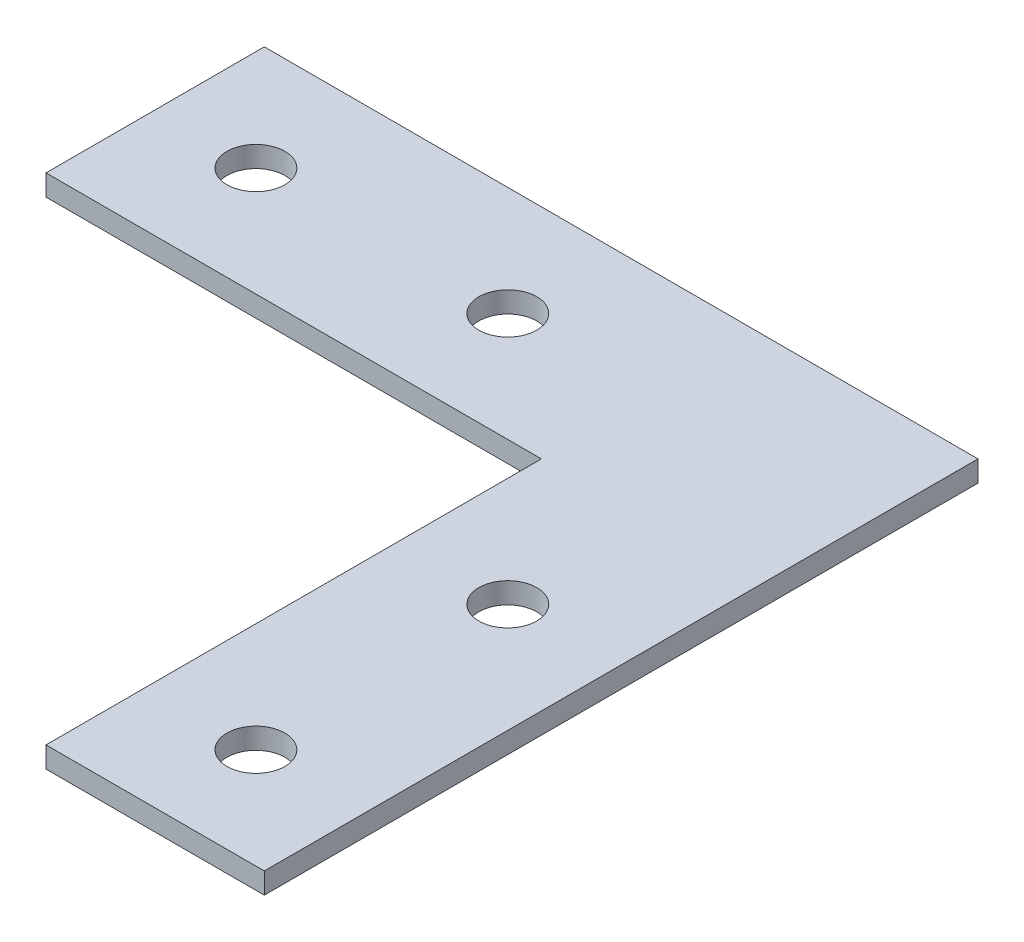
ISO-10303-21;
HEADER;
FILE_DESCRIPTION(('STEP AP214'),'2;1');
FILE_NAME('part.step','',(''),(''),'','','');
FILE_SCHEMA(('AUTOMOTIVE_DESIGN { 1 0 10303 214 1 1 1 1 }'));
ENDSEC;
DATA;
#1=APPLICATION_CONTEXT('core data for automotive mechanical design processes');
#2=APPLICATION_PROTOCOL_DEFINITION('international standard','automotive_design',2000,#1);
#3=PRODUCT_CONTEXT('',#1,'mechanical');
#4=PRODUCT('Part','Part','',(#3));
#5=PRODUCT_RELATED_PRODUCT_CATEGORY('part','',(#4));
#6=PRODUCT_DEFINITION_FORMATION('','',#4);
#7=PRODUCT_DEFINITION_CONTEXT('part definition',#1,'design');
#8=PRODUCT_DEFINITION('design','',#6,#7);
#9=PRODUCT_DEFINITION_SHAPE('','',#8);
#10=(LENGTH_UNIT() NAMED_UNIT(*) SI_UNIT(.MILLI.,.METRE.));
#11=(NAMED_UNIT(*) PLANE_ANGLE_UNIT() SI_UNIT($,.RADIAN.));
#12=(NAMED_UNIT(*) SI_UNIT($,.STERADIAN.) SOLID_ANGLE_UNIT());
#13=UNCERTAINTY_MEASURE_WITH_UNIT(LENGTH_MEASURE(1.E-05),#10,'distance_accuracy_value','');
#14=(GEOMETRIC_REPRESENTATION_CONTEXT(3) GLOBAL_UNCERTAINTY_ASSIGNED_CONTEXT((#13)) GLOBAL_UNIT_ASSIGNED_CONTEXT((#10,
#11,#12)) REPRESENTATION_CONTEXT('',''));
#15=CARTESIAN_POINT('',(0.,0.,0.));
#16=DIRECTION('',(0.,0.,1.));
#17=DIRECTION('',(1.,0.,0.));
#18=AXIS2_PLACEMENT_3D('',#15,#16,#17);
#19=CARTESIAN_POINT('',(0.,2.5,0.));
#20=DIRECTION('',(0.,-1.,0.));
#21=DIRECTION('',(0.,0.,-1.));
#22=AXIS2_PLACEMENT_3D('',#19,#20,#21);
#23=PLANE('',#22);
#24=DIRECTION('',(1.,0.,0.));
#25=VECTOR('',#24,1.);
#26=CARTESIAN_POINT('',(-59.,2.5,0.));
#27=LINE('',#26,#25);
#28=CARTESIAN_POINT('',(-59.,2.5,0.));
#29=VERTEX_POINT('',#28);
#30=CARTESIAN_POINT('',(0.,2.5,0.));
#31=VERTEX_POINT('',#30);
#32=EDGE_CURVE('E130',#29,#31,#27,.T.);
#33=ORIENTED_EDGE('',*,*,#32,.T.);
#34=DIRECTION('',(0.,0.,1.));
#35=VECTOR('',#34,1.);
#36=CARTESIAN_POINT('',(0.,2.5,0.));
#37=LINE('',#36,#35);
#38=CARTESIAN_POINT('',(0.,2.5,59.));
#39=VERTEX_POINT('',#38);
#40=EDGE_CURVE('E88',#31,#39,#37,.T.);
#41=ORIENTED_EDGE('',*,*,#40,.T.);
#42=DIRECTION('',(1.,0.,0.));
#43=VECTOR('',#42,1.);
#44=CARTESIAN_POINT('',(0.,2.5,59.));
#45=LINE('',#44,#43);
#46=CARTESIAN_POINT('',(26.,2.5,59.));
#47=VERTEX_POINT('',#46);
#48=EDGE_CURVE('E101',#39,#47,#45,.T.);
#49=ORIENTED_EDGE('',*,*,#48,.T.);
#50=DIRECTION('',(0.,0.,-1.));
#51=VECTOR('',#50,1.);
#52=CARTESIAN_POINT('',(26.,2.5,59.));
#53=LINE('',#52,#51);
#54=CARTESIAN_POINT('',(26.,2.5,-26.));
#55=VERTEX_POINT('',#54);
#56=EDGE_CURVE('E95',#47,#55,#53,.T.);
#57=ORIENTED_EDGE('',*,*,#56,.T.);
#58=DIRECTION('',(-1.,0.,0.));
#59=VECTOR('',#58,1.);
#60=CARTESIAN_POINT('',(26.,2.5,-26.));
#61=LINE('',#60,#59);
#62=CARTESIAN_POINT('',(-59.,2.5,-26.));
#63=VERTEX_POINT('',#62);
#64=EDGE_CURVE('E99',#55,#63,#61,.T.);
#65=ORIENTED_EDGE('',*,*,#64,.T.);
#66=DIRECTION('',(0.,0.,1.));
#67=VECTOR('',#66,1.);
#68=CARTESIAN_POINT('',(-59.,2.5,-26.));
#69=LINE('',#68,#67);
#70=EDGE_CURVE('E51',#63,#29,#69,.T.);
#71=ORIENTED_EDGE('',*,*,#70,.T.);
#72=EDGE_LOOP('',(#33,#41,#49,#57,#65,#71));
#73=FACE_BOUND('',#72,.T.);
#74=CARTESIAN_POINT('',(-47.,2.5,-13.));
#75=DIRECTION('',(0.,1.,0.));
#76=DIRECTION('',(0.,0.,1.));
#77=AXIS2_PLACEMENT_3D('',#74,#75,#76);
#78=CIRCLE('',#77,3.45);
#79=CARTESIAN_POINT('',(-47.,2.5,-9.55));
#80=VERTEX_POINT('',#79);
#81=EDGE_CURVE('E123',#80,#80,#78,.T.);
#82=ORIENTED_EDGE('',*,*,#81,.F.);
#83=EDGE_LOOP('',(#82));
#84=FACE_BOUND('',#83,.T.);
#85=CARTESIAN_POINT('',(-17.,2.5,-13.));
#86=DIRECTION('',(0.,1.,0.));
#87=DIRECTION('',(0.,0.,1.));
#88=AXIS2_PLACEMENT_3D('',#85,#86,#87);
#89=CIRCLE('',#88,3.45);
#90=CARTESIAN_POINT('',(-17.,2.5,-9.55));
#91=VERTEX_POINT('',#90);
#92=EDGE_CURVE('E194',#91,#91,#89,.T.);
#93=ORIENTED_EDGE('',*,*,#92,.F.);
#94=EDGE_LOOP('',(#93));
#95=FACE_BOUND('',#94,.T.);
#96=CARTESIAN_POINT('',(13.,2.5,47.));
#97=DIRECTION('',(0.,1.,0.));
#98=DIRECTION('',(0.,0.,1.));
#99=AXIS2_PLACEMENT_3D('',#96,#97,#98);
#100=CIRCLE('',#99,3.45);
#101=CARTESIAN_POINT('',(13.,2.5,50.45));
#102=VERTEX_POINT('',#101);
#103=EDGE_CURVE('E188',#102,#102,#100,.T.);
#104=ORIENTED_EDGE('',*,*,#103,.F.);
#105=EDGE_LOOP('',(#104));
#106=FACE_BOUND('',#105,.T.);
#107=CARTESIAN_POINT('',(13.,2.5,17.));
#108=DIRECTION('',(0.,1.,0.));
#109=DIRECTION('',(0.,0.,1.));
#110=AXIS2_PLACEMENT_3D('',#107,#108,#109);
#111=CIRCLE('',#110,3.45);
#112=CARTESIAN_POINT('',(13.,2.5,20.45));
#113=VERTEX_POINT('',#112);
#114=EDGE_CURVE('E179',#113,#113,#111,.T.);
#115=ORIENTED_EDGE('',*,*,#114,.F.);
#116=EDGE_LOOP('',(#115));
#117=FACE_BOUND('',#116,.T.);
#118=ADVANCED_FACE('F34',(#73,#84,#95,#106,#117),#23,.F.);
#119=CARTESIAN_POINT('',(0.,0.,0.));
#120=DIRECTION('',(0.,-1.,0.));
#121=DIRECTION('',(0.,0.,-1.));
#122=AXIS2_PLACEMENT_3D('',#119,#120,#121);
#123=PLANE('',#122);
#124=CARTESIAN_POINT('',(13.,0.,47.));
#125=DIRECTION('',(0.,1.,0.));
#126=DIRECTION('',(0.,0.,1.));
#127=AXIS2_PLACEMENT_3D('',#124,#125,#126);
#128=CIRCLE('',#127,3.45);
#129=CARTESIAN_POINT('',(13.,0.,50.45));
#130=VERTEX_POINT('',#129);
#131=EDGE_CURVE('E185',#130,#130,#128,.T.);
#132=ORIENTED_EDGE('',*,*,#131,.T.);
#133=EDGE_LOOP('',(#132));
#134=FACE_BOUND('',#133,.T.);
#135=CARTESIAN_POINT('',(-47.,0.,-13.));
#136=DIRECTION('',(0.,1.,0.));
#137=DIRECTION('',(0.,0.,1.));
#138=AXIS2_PLACEMENT_3D('',#135,#136,#137);
#139=CIRCLE('',#138,3.45);
#140=CARTESIAN_POINT('',(-47.,0.,-9.55));
#141=VERTEX_POINT('',#140);
#142=EDGE_CURVE('E197',#141,#141,#139,.T.);
#143=ORIENTED_EDGE('',*,*,#142,.T.);
#144=EDGE_LOOP('',(#143));
#145=FACE_BOUND('',#144,.T.);
#146=DIRECTION('',(1.,0.,0.));
#147=VECTOR('',#146,1.);
#148=CARTESIAN_POINT('',(-59.,0.,0.));
#149=LINE('',#148,#147);
#150=CARTESIAN_POINT('',(-59.,0.,0.));
#151=VERTEX_POINT('',#150);
#152=CARTESIAN_POINT('',(0.,0.,0.));
#153=VERTEX_POINT('',#152);
#154=EDGE_CURVE('E119',#151,#153,#149,.T.);
#155=ORIENTED_EDGE('',*,*,#154,.F.);
#156=DIRECTION('',(0.,0.,1.));
#157=VECTOR('',#156,1.);
#158=CARTESIAN_POINT('',(-59.,0.,-26.));
#159=LINE('',#158,#157);
#160=CARTESIAN_POINT('',(-59.,0.,-26.));
#161=VERTEX_POINT('',#160);
#162=EDGE_CURVE('E80',#161,#151,#159,.T.);
#163=ORIENTED_EDGE('',*,*,#162,.F.);
#164=DIRECTION('',(-1.,0.,0.));
#165=VECTOR('',#164,1.);
#166=CARTESIAN_POINT('',(26.,0.,-26.));
#167=LINE('',#166,#165);
#168=CARTESIAN_POINT('',(26.,0.,-26.));
#169=VERTEX_POINT('',#168);
#170=EDGE_CURVE('E74',#169,#161,#167,.T.);
#171=ORIENTED_EDGE('',*,*,#170,.F.);
#172=DIRECTION('',(0.,0.,-1.));
#173=VECTOR('',#172,1.);
#174=CARTESIAN_POINT('',(26.,0.,59.));
#175=LINE('',#174,#173);
#176=CARTESIAN_POINT('',(26.,0.,59.));
#177=VERTEX_POINT('',#176);
#178=EDGE_CURVE('E109',#177,#169,#175,.T.);
#179=ORIENTED_EDGE('',*,*,#178,.F.);
#180=DIRECTION('',(1.,0.,0.));
#181=VECTOR('',#180,1.);
#182=CARTESIAN_POINT('',(0.,0.,59.));
#183=LINE('',#182,#181);
#184=CARTESIAN_POINT('',(0.,0.,59.));
#185=VERTEX_POINT('',#184);
#186=EDGE_CURVE('E125',#185,#177,#183,.T.);
#187=ORIENTED_EDGE('',*,*,#186,.F.);
#188=DIRECTION('',(0.,0.,1.));
#189=VECTOR('',#188,1.);
#190=CARTESIAN_POINT('',(0.,0.,0.));
#191=LINE('',#190,#189);
#192=EDGE_CURVE('E122',#153,#185,#191,.T.);
#193=ORIENTED_EDGE('',*,*,#192,.F.);
#194=EDGE_LOOP('',(#155,#163,#171,#179,#187,#193));
#195=FACE_BOUND('',#194,.T.);
#196=CARTESIAN_POINT('',(-17.,0.,-13.));
#197=DIRECTION('',(0.,1.,0.));
#198=DIRECTION('',(0.,0.,1.));
#199=AXIS2_PLACEMENT_3D('',#196,#197,#198);
#200=CIRCLE('',#199,3.45);
#201=CARTESIAN_POINT('',(-17.,0.,-9.55));
#202=VERTEX_POINT('',#201);
#203=EDGE_CURVE('E191',#202,#202,#200,.T.);
#204=ORIENTED_EDGE('',*,*,#203,.T.);
#205=EDGE_LOOP('',(#204));
#206=FACE_BOUND('',#205,.T.);
#207=CARTESIAN_POINT('',(13.,0.,17.));
#208=DIRECTION('',(0.,1.,0.));
#209=DIRECTION('',(0.,0.,1.));
#210=AXIS2_PLACEMENT_3D('',#207,#208,#209);
#211=CIRCLE('',#210,3.45);
#212=CARTESIAN_POINT('',(13.,0.,20.45));
#213=VERTEX_POINT('',#212);
#214=EDGE_CURVE('E182',#213,#213,#211,.T.);
#215=ORIENTED_EDGE('',*,*,#214,.T.);
#216=EDGE_LOOP('',(#215));
#217=FACE_BOUND('',#216,.T.);
#218=ADVANCED_FACE('F139',(#134,#145,#195,#206,#217),#123,.T.);
#219=CARTESIAN_POINT('',(-59.,2.5,0.));
#220=DIRECTION('',(0.,0.,-1.));
#221=DIRECTION('',(-1.,0.,0.));
#222=AXIS2_PLACEMENT_3D('',#219,#220,#221);
#223=PLANE('',#222);
#224=ORIENTED_EDGE('',*,*,#154,.T.);
#225=DIRECTION('',(0.,-1.,0.));
#226=VECTOR('',#225,1.);
#227=CARTESIAN_POINT('',(0.,2.5,0.));
#228=LINE('',#227,#226);
#229=EDGE_CURVE('E11',#31,#153,#228,.T.);
#230=ORIENTED_EDGE('',*,*,#229,.F.);
#231=ORIENTED_EDGE('',*,*,#32,.F.);
#232=DIRECTION('',(0.,-1.,0.));
#233=VECTOR('',#232,1.);
#234=CARTESIAN_POINT('',(-59.,2.5,0.));
#235=LINE('',#234,#233);
#236=EDGE_CURVE('E115',#29,#151,#235,.T.);
#237=ORIENTED_EDGE('',*,*,#236,.T.);
#238=EDGE_LOOP('',(#224,#230,#231,#237));
#239=FACE_BOUND('',#238,.T.);
#240=ADVANCED_FACE('F36',(#239),#223,.F.);
#241=CARTESIAN_POINT('',(0.,2.5,0.));
#242=DIRECTION('',(1.,0.,0.));
#243=DIRECTION('',(0.,0.,-1.));
#244=AXIS2_PLACEMENT_3D('',#241,#242,#243);
#245=PLANE('',#244);
#246=ORIENTED_EDGE('',*,*,#192,.T.);
#247=DIRECTION('',(0.,-1.,0.));
#248=VECTOR('',#247,1.);
#249=CARTESIAN_POINT('',(0.,2.5,59.));
#250=LINE('',#249,#248);
#251=EDGE_CURVE('E43',#39,#185,#250,.T.);
#252=ORIENTED_EDGE('',*,*,#251,.F.);
#253=ORIENTED_EDGE('',*,*,#40,.F.);
#254=ORIENTED_EDGE('',*,*,#229,.T.);
#255=EDGE_LOOP('',(#246,#252,#253,#254));
#256=FACE_BOUND('',#255,.T.);
#257=ADVANCED_FACE('F257',(#256),#245,.F.);
#258=CARTESIAN_POINT('',(0.,2.5,59.));
#259=DIRECTION('',(0.,0.,-1.));
#260=DIRECTION('',(-1.,0.,0.));
#261=AXIS2_PLACEMENT_3D('',#258,#259,#260);
#262=PLANE('',#261);
#263=ORIENTED_EDGE('',*,*,#186,.T.);
#264=DIRECTION('',(0.,-1.,0.));
#265=VECTOR('',#264,1.);
#266=CARTESIAN_POINT('',(26.,2.5,59.));
#267=LINE('',#266,#265);
#268=EDGE_CURVE('E110',#47,#177,#267,.T.);
#269=ORIENTED_EDGE('',*,*,#268,.F.);
#270=ORIENTED_EDGE('',*,*,#48,.F.);
#271=ORIENTED_EDGE('',*,*,#251,.T.);
#272=EDGE_LOOP('',(#263,#269,#270,#271));
#273=FACE_BOUND('',#272,.T.);
#274=ADVANCED_FACE('F136',(#273),#262,.F.);
#275=CARTESIAN_POINT('',(26.,2.5,59.));
#276=DIRECTION('',(-1.,0.,0.));
#277=DIRECTION('',(0.,0.,1.));
#278=AXIS2_PLACEMENT_3D('',#275,#276,#277);
#279=PLANE('',#278);
#280=ORIENTED_EDGE('',*,*,#178,.T.);
#281=DIRECTION('',(0.,-1.,0.));
#282=VECTOR('',#281,1.);
#283=CARTESIAN_POINT('',(26.,2.5,-26.));
#284=LINE('',#283,#282);
#285=EDGE_CURVE('E106',#55,#169,#284,.T.);
#286=ORIENTED_EDGE('',*,*,#285,.F.);
#287=ORIENTED_EDGE('',*,*,#56,.F.);
#288=ORIENTED_EDGE('',*,*,#268,.T.);
#289=EDGE_LOOP('',(#280,#286,#287,#288));
#290=FACE_BOUND('',#289,.T.);
#291=ADVANCED_FACE('F107',(#290),#279,.F.);
#292=CARTESIAN_POINT('',(26.,2.5,-26.));
#293=DIRECTION('',(0.,0.,1.));
#294=DIRECTION('',(1.,0.,0.));
#295=AXIS2_PLACEMENT_3D('',#292,#293,#294);
#296=PLANE('',#295);
#297=ORIENTED_EDGE('',*,*,#170,.T.);
#298=DIRECTION('',(0.,-1.,0.));
#299=VECTOR('',#298,1.);
#300=CARTESIAN_POINT('',(-59.,2.5,-26.));
#301=LINE('',#300,#299);
#302=EDGE_CURVE('E111',#63,#161,#301,.T.);
#303=ORIENTED_EDGE('',*,*,#302,.F.);
#304=ORIENTED_EDGE('',*,*,#64,.F.);
#305=ORIENTED_EDGE('',*,*,#285,.T.);
#306=EDGE_LOOP('',(#297,#303,#304,#305));
#307=FACE_BOUND('',#306,.T.);
#308=ADVANCED_FACE('F113',(#307),#296,.F.);
#309=CARTESIAN_POINT('',(-59.,2.5,-26.));
#310=DIRECTION('',(1.,0.,0.));
#311=DIRECTION('',(0.,0.,-1.));
#312=AXIS2_PLACEMENT_3D('',#309,#310,#311);
#313=PLANE('',#312);
#314=ORIENTED_EDGE('',*,*,#162,.T.);
#315=ORIENTED_EDGE('',*,*,#236,.F.);
#316=ORIENTED_EDGE('',*,*,#70,.F.);
#317=ORIENTED_EDGE('',*,*,#302,.T.);
#318=EDGE_LOOP('',(#314,#315,#316,#317));
#319=FACE_BOUND('',#318,.T.);
#320=ADVANCED_FACE('F144',(#319),#313,.F.);
#321=CARTESIAN_POINT('',(-47.,2.5,-13.));
#322=DIRECTION('',(0.,-1.,0.));
#323=DIRECTION('',(0.,0.,-1.));
#324=AXIS2_PLACEMENT_3D('',#321,#322,#323);
#325=CYLINDRICAL_SURFACE('',#324,3.45);
#326=ORIENTED_EDGE('',*,*,#81,.T.);
#327=EDGE_LOOP('',(#326));
#328=FACE_BOUND('',#327,.T.);
#329=ORIENTED_EDGE('',*,*,#142,.F.);
#330=EDGE_LOOP('',(#329));
#331=FACE_BOUND('',#330,.T.);
#332=ADVANCED_FACE('F146',(#328,#331),#325,.F.);
#333=CARTESIAN_POINT('',(-17.,2.5,-13.));
#334=DIRECTION('',(0.,-1.,0.));
#335=DIRECTION('',(0.,0.,-1.));
#336=AXIS2_PLACEMENT_3D('',#333,#334,#335);
#337=CYLINDRICAL_SURFACE('',#336,3.45);
#338=ORIENTED_EDGE('',*,*,#92,.T.);
#339=EDGE_LOOP('',(#338));
#340=FACE_BOUND('',#339,.T.);
#341=ORIENTED_EDGE('',*,*,#203,.F.);
#342=EDGE_LOOP('',(#341));
#343=FACE_BOUND('',#342,.T.);
#344=ADVANCED_FACE('F152',(#340,#343),#337,.F.);
#345=CARTESIAN_POINT('',(13.,2.5,47.));
#346=DIRECTION('',(0.,-1.,0.));
#347=DIRECTION('',(0.,0.,-1.));
#348=AXIS2_PLACEMENT_3D('',#345,#346,#347);
#349=CYLINDRICAL_SURFACE('',#348,3.45);
#350=ORIENTED_EDGE('',*,*,#103,.T.);
#351=EDGE_LOOP('',(#350));
#352=FACE_BOUND('',#351,.T.);
#353=ORIENTED_EDGE('',*,*,#131,.F.);
#354=EDGE_LOOP('',(#353));
#355=FACE_BOUND('',#354,.T.);
#356=ADVANCED_FACE('F166',(#352,#355),#349,.F.);
#357=CARTESIAN_POINT('',(13.,2.5,17.));
#358=DIRECTION('',(0.,-1.,0.));
#359=DIRECTION('',(0.,0.,-1.));
#360=AXIS2_PLACEMENT_3D('',#357,#358,#359);
#361=CYLINDRICAL_SURFACE('',#360,3.45);
#362=ORIENTED_EDGE('',*,*,#114,.T.);
#363=EDGE_LOOP('',(#362));
#364=FACE_BOUND('',#363,.T.);
#365=ORIENTED_EDGE('',*,*,#214,.F.);
#366=EDGE_LOOP('',(#365));
#367=FACE_BOUND('',#366,.T.);
#368=ADVANCED_FACE('F170',(#364,#367),#361,.F.);
#369=CLOSED_SHELL('',(#118,#218,#240,#257,#274,#291,#308,#320,#332,#344,#356,#368));
#370=MANIFOLD_SOLID_BREP('B2',#369);
#371=ADVANCED_BREP_SHAPE_REPRESENTATION('',(#18,#370),#14);
#372=SHAPE_DEFINITION_REPRESENTATION(#9,#371);
ENDSEC;
END-ISO-10303-21;
